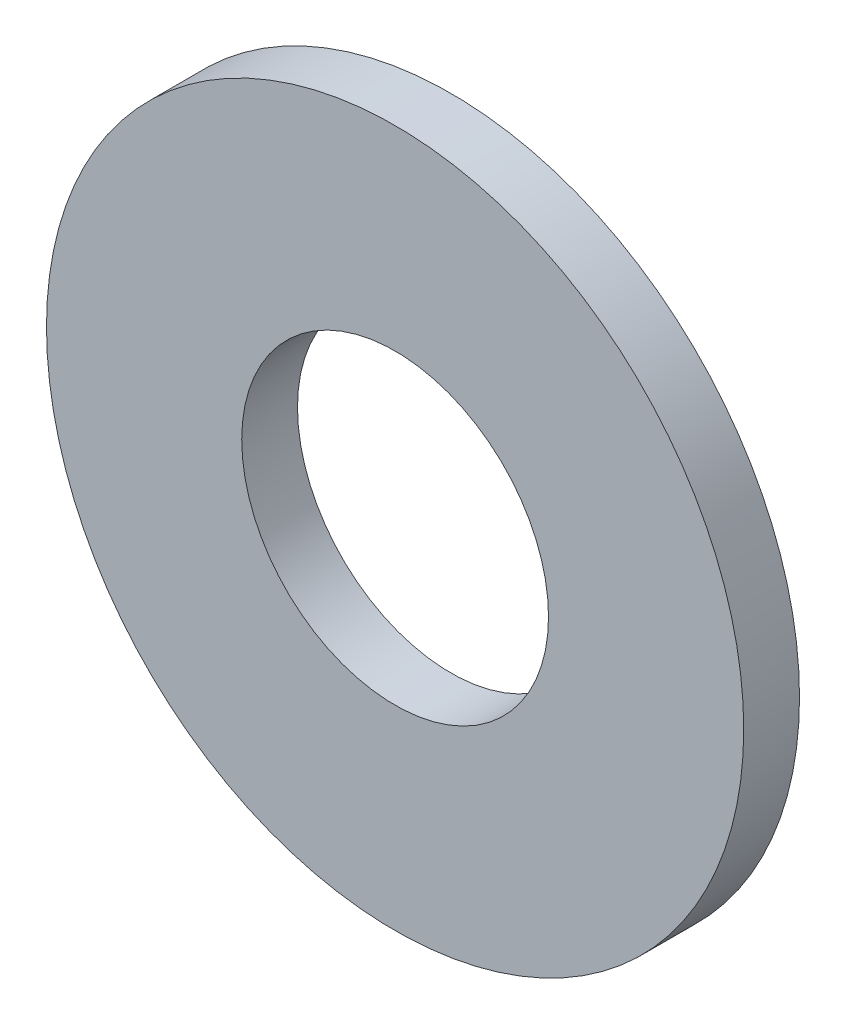
ISO-10303-21;
HEADER;
FILE_DESCRIPTION(('STEP AP214'),'2;1');
FILE_NAME('part.step','',(''),(''),'','','');
FILE_SCHEMA(('AUTOMOTIVE_DESIGN { 1 0 10303 214 1 1 1 1 }'));
ENDSEC;
DATA;
#1=APPLICATION_CONTEXT('core data for automotive mechanical design processes');
#2=APPLICATION_PROTOCOL_DEFINITION('international standard','automotive_design',2000,#1);
#3=PRODUCT_CONTEXT('',#1,'mechanical');
#4=PRODUCT('Part','Part','',(#3));
#5=PRODUCT_RELATED_PRODUCT_CATEGORY('part','',(#4));
#6=PRODUCT_DEFINITION_FORMATION('','',#4);
#7=PRODUCT_DEFINITION_CONTEXT('part definition',#1,'design');
#8=PRODUCT_DEFINITION('design','',#6,#7);
#9=PRODUCT_DEFINITION_SHAPE('','',#8);
#10=(LENGTH_UNIT() NAMED_UNIT(*) SI_UNIT(.MILLI.,.METRE.));
#11=(NAMED_UNIT(*) PLANE_ANGLE_UNIT() SI_UNIT($,.RADIAN.));
#12=(NAMED_UNIT(*) SI_UNIT($,.STERADIAN.) SOLID_ANGLE_UNIT());
#13=UNCERTAINTY_MEASURE_WITH_UNIT(LENGTH_MEASURE(1.E-05),#10,'distance_accuracy_value','');
#14=(GEOMETRIC_REPRESENTATION_CONTEXT(3) GLOBAL_UNCERTAINTY_ASSIGNED_CONTEXT((#13)) GLOBAL_UNIT_ASSIGNED_CONTEXT((#10,
#11,#12)) REPRESENTATION_CONTEXT('',''));
#15=CARTESIAN_POINT('',(0.,0.,0.));
#16=DIRECTION('',(0.,0.,1.));
#17=DIRECTION('',(1.,0.,0.));
#18=AXIS2_PLACEMENT_3D('',#15,#16,#17);
#19=CARTESIAN_POINT('',(0.,0.,0.4));
#20=DIRECTION('',(0.,0.,1.));
#21=DIRECTION('',(1.,0.,0.));
#22=AXIS2_PLACEMENT_3D('',#19,#20,#21);
#23=PLANE('',#22);
#24=CARTESIAN_POINT('',(0.,0.,0.4));
#25=DIRECTION('',(0.,0.,1.));
#26=DIRECTION('',(1.,0.,0.));
#27=AXIS2_PLACEMENT_3D('',#24,#25,#26);
#28=CIRCLE('',#27,2.5);
#29=CARTESIAN_POINT('',(2.5,0.,0.4));
#30=VERTEX_POINT('',#29);
#31=EDGE_CURVE('E10',#30,#30,#28,.T.);
#32=ORIENTED_EDGE('',*,*,#31,.T.);
#33=EDGE_LOOP('',(#32));
#34=FACE_BOUND('',#33,.T.);
#35=CARTESIAN_POINT('',(0.,0.,0.4));
#36=DIRECTION('',(0.,0.,1.));
#37=DIRECTION('',(1.,0.,0.));
#38=AXIS2_PLACEMENT_3D('',#35,#36,#37);
#39=CIRCLE('',#38,1.1);
#40=CARTESIAN_POINT('',(1.1,0.,0.4));
#41=VERTEX_POINT('',#40);
#42=EDGE_CURVE('E41',#41,#41,#39,.T.);
#43=ORIENTED_EDGE('',*,*,#42,.F.);
#44=EDGE_LOOP('',(#43));
#45=FACE_BOUND('',#44,.T.);
#46=ADVANCED_FACE('F30',(#34,#45),#23,.T.);
#47=CARTESIAN_POINT('',(0.,0.,0.));
#48=DIRECTION('',(0.,0.,1.));
#49=DIRECTION('',(1.,0.,0.));
#50=AXIS2_PLACEMENT_3D('',#47,#48,#49);
#51=PLANE('',#50);
#52=CARTESIAN_POINT('',(0.,0.,0.));
#53=DIRECTION('',(0.,0.,1.));
#54=DIRECTION('',(1.,0.,0.));
#55=AXIS2_PLACEMENT_3D('',#52,#53,#54);
#56=CIRCLE('',#55,2.5);
#57=CARTESIAN_POINT('',(2.5,0.,0.));
#58=VERTEX_POINT('',#57);
#59=EDGE_CURVE('E34',#58,#58,#56,.T.);
#60=ORIENTED_EDGE('',*,*,#59,.F.);
#61=EDGE_LOOP('',(#60));
#62=FACE_BOUND('',#61,.T.);
#63=CARTESIAN_POINT('',(0.,0.,0.));
#64=DIRECTION('',(0.,0.,1.));
#65=DIRECTION('',(1.,0.,0.));
#66=AXIS2_PLACEMENT_3D('',#63,#64,#65);
#67=CIRCLE('',#66,1.1);
#68=CARTESIAN_POINT('',(1.1,0.,0.));
#69=VERTEX_POINT('',#68);
#70=EDGE_CURVE('E43',#69,#69,#67,.T.);
#71=ORIENTED_EDGE('',*,*,#70,.T.);
#72=EDGE_LOOP('',(#71));
#73=FACE_BOUND('',#72,.T.);
#74=ADVANCED_FACE('F53',(#62,#73),#51,.F.);
#75=CARTESIAN_POINT('',(0.,0.,0.4));
#76=DIRECTION('',(0.,0.,-1.));
#77=DIRECTION('',(-1.,0.,0.));
#78=AXIS2_PLACEMENT_3D('',#75,#76,#77);
#79=CYLINDRICAL_SURFACE('',#78,2.5);
#80=ORIENTED_EDGE('',*,*,#31,.F.);
#81=EDGE_LOOP('',(#80));
#82=FACE_BOUND('',#81,.T.);
#83=ORIENTED_EDGE('',*,*,#59,.T.);
#84=EDGE_LOOP('',(#83));
#85=FACE_BOUND('',#84,.T.);
#86=ADVANCED_FACE('F32',(#82,#85),#79,.T.);
#87=CARTESIAN_POINT('',(0.,0.,0.4));
#88=DIRECTION('',(0.,0.,-1.));
#89=DIRECTION('',(-1.,0.,0.));
#90=AXIS2_PLACEMENT_3D('',#87,#88,#89);
#91=CYLINDRICAL_SURFACE('',#90,1.1);
#92=ORIENTED_EDGE('',*,*,#42,.T.);
#93=EDGE_LOOP('',(#92));
#94=FACE_BOUND('',#93,.T.);
#95=ORIENTED_EDGE('',*,*,#70,.F.);
#96=EDGE_LOOP('',(#95));
#97=FACE_BOUND('',#96,.T.);
#98=ADVANCED_FACE('F49',(#94,#97),#91,.F.);
#99=CLOSED_SHELL('',(#46,#74,#86,#98));
#100=MANIFOLD_SOLID_BREP('B2',#99);
#101=ADVANCED_BREP_SHAPE_REPRESENTATION('',(#18,#100),#14);
#102=SHAPE_DEFINITION_REPRESENTATION(#9,#101);
ENDSEC;
END-ISO-10303-21;
